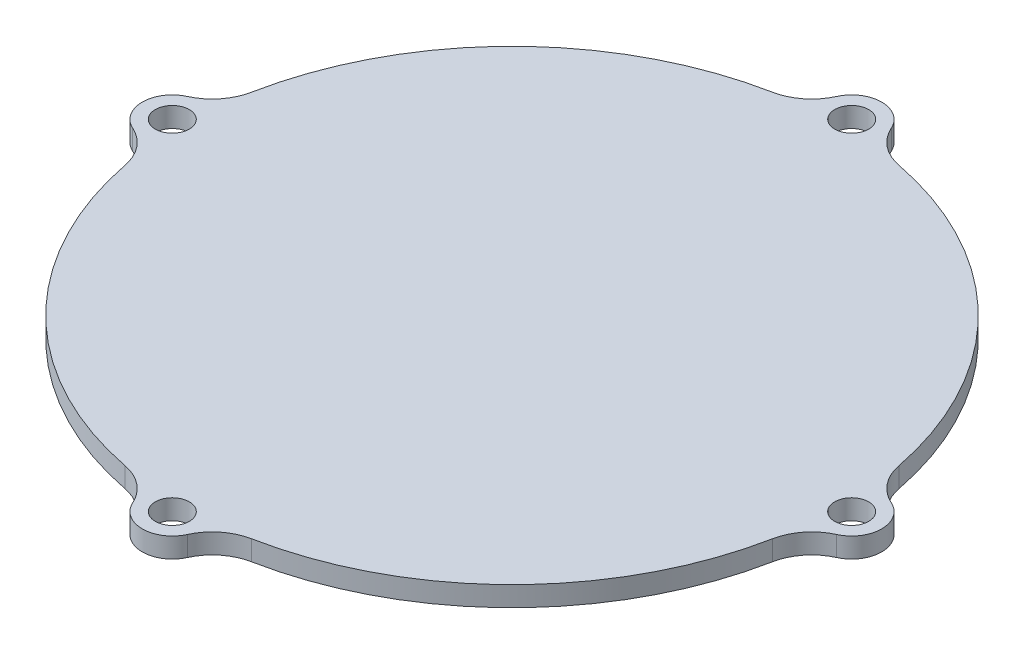
ISO-10303-21;
HEADER;
FILE_DESCRIPTION(('STEP AP214'),'2;1');
FILE_NAME('part.step','',(''),(''),'','','');
FILE_SCHEMA(('AUTOMOTIVE_DESIGN { 1 0 10303 214 1 1 1 1 }'));
ENDSEC;
DATA;
#1=APPLICATION_CONTEXT('core data for automotive mechanical design processes');
#2=APPLICATION_PROTOCOL_DEFINITION('international standard','automotive_design',2000,#1);
#3=PRODUCT_CONTEXT('',#1,'mechanical');
#4=PRODUCT('Part','Part','',(#3));
#5=PRODUCT_RELATED_PRODUCT_CATEGORY('part','',(#4));
#6=PRODUCT_DEFINITION_FORMATION('','',#4);
#7=PRODUCT_DEFINITION_CONTEXT('part definition',#1,'design');
#8=PRODUCT_DEFINITION('design','',#6,#7);
#9=PRODUCT_DEFINITION_SHAPE('','',#8);
#10=(LENGTH_UNIT() NAMED_UNIT(*) SI_UNIT(.MILLI.,.METRE.));
#11=(NAMED_UNIT(*) PLANE_ANGLE_UNIT() SI_UNIT($,.RADIAN.));
#12=(NAMED_UNIT(*) SI_UNIT($,.STERADIAN.) SOLID_ANGLE_UNIT());
#13=UNCERTAINTY_MEASURE_WITH_UNIT(LENGTH_MEASURE(1.E-05),#10,'distance_accuracy_value','');
#14=(GEOMETRIC_REPRESENTATION_CONTEXT(3) GLOBAL_UNCERTAINTY_ASSIGNED_CONTEXT((#13)) GLOBAL_UNIT_ASSIGNED_CONTEXT((#10,
#11,#12)) REPRESENTATION_CONTEXT('',''));
#15=CARTESIAN_POINT('',(0.,0.,0.));
#16=DIRECTION('',(0.,0.,1.));
#17=DIRECTION('',(1.,0.,0.));
#18=AXIS2_PLACEMENT_3D('',#15,#16,#17);
#19=CARTESIAN_POINT('',(0.,2.,0.));
#20=DIRECTION('',(0.,-1.,0.));
#21=DIRECTION('',(0.,0.,-1.));
#22=AXIS2_PLACEMENT_3D('',#19,#20,#21);
#23=CYLINDRICAL_SURFACE('',#22,33.);
#24=CARTESIAN_POINT('',(0.,0.,0.));
#25=DIRECTION('',(0.,1.,0.));
#26=DIRECTION('',(0.,0.,1.));
#27=AXIS2_PLACEMENT_3D('',#24,#25,#26);
#28=CIRCLE('',#27,33.);
#29=CARTESIAN_POINT('',(-6.33106875169509,0.,-32.3869969040248));
#30=VERTEX_POINT('',#29);
#31=CARTESIAN_POINT('',(-32.3869969040247,0.,-6.33106875169543));
#32=VERTEX_POINT('',#31);
#33=EDGE_CURVE('E165',#30,#32,#28,.T.);
#34=ORIENTED_EDGE('',*,*,#33,.T.);
#35=DIRECTION('',(0.,-1.,0.));
#36=VECTOR('',#35,1.);
#37=CARTESIAN_POINT('',(-32.3869969040247,2.,-6.33106875169543));
#38=LINE('',#37,#36);
#39=CARTESIAN_POINT('',(-32.3869969040247,2.,-6.33106875169543));
#40=VERTEX_POINT('',#39);
#41=EDGE_CURVE('E259',#32,#40,#38,.F.);
#42=ORIENTED_EDGE('',*,*,#41,.T.);
#43=CARTESIAN_POINT('',(0.,2.,0.));
#44=DIRECTION('',(0.,1.,0.));
#45=DIRECTION('',(0.,0.,1.));
#46=AXIS2_PLACEMENT_3D('',#43,#44,#45);
#47=CIRCLE('',#46,33.);
#48=CARTESIAN_POINT('',(-6.33106875169509,2.,-32.3869969040248));
#49=VERTEX_POINT('',#48);
#50=EDGE_CURVE('E167',#49,#40,#47,.T.);
#51=ORIENTED_EDGE('',*,*,#50,.F.);
#52=DIRECTION('',(0.,-1.,0.));
#53=VECTOR('',#52,1.);
#54=CARTESIAN_POINT('',(-6.3310687516951,2.,-32.3869969040248));
#55=LINE('',#54,#53);
#56=EDGE_CURVE('E157',#49,#30,#55,.T.);
#57=ORIENTED_EDGE('',*,*,#56,.T.);
#58=EDGE_LOOP('',(#34,#42,#51,#57));
#59=FACE_BOUND('',#58,.T.);
#60=ADVANCED_FACE('F40',(#59),#23,.T.);
#61=CARTESIAN_POINT('',(-32.3869969040248,2.,6.33106875169476));
#62=VERTEX_POINT('',#61);
#63=CARTESIAN_POINT('',(-6.33106875169509,2.,32.3869969040248));
#64=VERTEX_POINT('',#63);
#65=EDGE_CURVE('E196',#62,#64,#47,.T.);
#66=ORIENTED_EDGE('',*,*,#65,.F.);
#67=DIRECTION('',(0.,-1.,0.));
#68=VECTOR('',#67,1.);
#69=CARTESIAN_POINT('',(-32.3869969040248,2.,6.33106875169476));
#70=LINE('',#69,#68);
#71=CARTESIAN_POINT('',(-32.3869969040248,0.,6.33106875169476));
#72=VERTEX_POINT('',#71);
#73=EDGE_CURVE('E252',#62,#72,#70,.T.);
#74=ORIENTED_EDGE('',*,*,#73,.T.);
#75=CARTESIAN_POINT('',(-6.33106875169509,0.,32.3869969040248));
#76=VERTEX_POINT('',#75);
#77=EDGE_CURVE('E174',#72,#76,#28,.T.);
#78=ORIENTED_EDGE('',*,*,#77,.T.);
#79=DIRECTION('',(0.,-1.,0.));
#80=VECTOR('',#79,1.);
#81=CARTESIAN_POINT('',(-6.3310687516951,2.,32.3869969040248));
#82=LINE('',#81,#80);
#83=EDGE_CURVE('E241',#76,#64,#82,.F.);
#84=ORIENTED_EDGE('',*,*,#83,.T.);
#85=EDGE_LOOP('',(#66,#74,#78,#84));
#86=FACE_BOUND('',#85,.T.);
#87=ADVANCED_FACE('F288',(#86),#23,.T.);
#88=CARTESIAN_POINT('',(6.33106875169509,2.,32.3869969040248));
#89=VERTEX_POINT('',#88);
#90=CARTESIAN_POINT('',(32.3869969040247,2.,6.33106875169521));
#91=VERTEX_POINT('',#90);
#92=EDGE_CURVE('E177',#89,#91,#47,.T.);
#93=ORIENTED_EDGE('',*,*,#92,.F.);
#94=DIRECTION('',(0.,-1.,0.));
#95=VECTOR('',#94,1.);
#96=CARTESIAN_POINT('',(6.3310687516951,2.,32.3869969040248));
#97=LINE('',#96,#95);
#98=CARTESIAN_POINT('',(6.33106875169509,0.,32.3869969040248));
#99=VERTEX_POINT('',#98);
#100=EDGE_CURVE('E235',#89,#99,#97,.T.);
#101=ORIENTED_EDGE('',*,*,#100,.T.);
#102=CARTESIAN_POINT('',(32.3869969040247,0.,6.33106875169521));
#103=VERTEX_POINT('',#102);
#104=EDGE_CURVE('E179',#99,#103,#28,.T.);
#105=ORIENTED_EDGE('',*,*,#104,.T.);
#106=DIRECTION('',(0.,-1.,0.));
#107=VECTOR('',#106,1.);
#108=CARTESIAN_POINT('',(32.3869969040248,2.,6.33106875169521));
#109=LINE('',#108,#107);
#110=EDGE_CURVE('E218',#103,#91,#109,.F.);
#111=ORIENTED_EDGE('',*,*,#110,.T.);
#112=EDGE_LOOP('',(#93,#101,#105,#111));
#113=FACE_BOUND('',#112,.T.);
#114=ADVANCED_FACE('F223',(#113),#23,.T.);
#115=CARTESIAN_POINT('',(32.3869969040248,2.,-6.33106875169498));
#116=VERTEX_POINT('',#115);
#117=CARTESIAN_POINT('',(6.33106875169509,2.,-32.3869969040248));
#118=VERTEX_POINT('',#117);
#119=EDGE_CURVE('E173',#116,#118,#47,.T.);
#120=ORIENTED_EDGE('',*,*,#119,.F.);
#121=DIRECTION('',(0.,-1.,0.));
#122=VECTOR('',#121,1.);
#123=CARTESIAN_POINT('',(32.3869969040248,2.,-6.33106875169498));
#124=LINE('',#123,#122);
#125=CARTESIAN_POINT('',(32.3869969040248,0.,-6.33106875169498));
#126=VERTEX_POINT('',#125);
#127=EDGE_CURVE('E306',#116,#126,#124,.T.);
#128=ORIENTED_EDGE('',*,*,#127,.T.);
#129=CARTESIAN_POINT('',(6.33106875169509,0.,-32.3869969040248));
#130=VERTEX_POINT('',#129);
#131=EDGE_CURVE('E176',#126,#130,#28,.T.);
#132=ORIENTED_EDGE('',*,*,#131,.T.);
#133=DIRECTION('',(0.,-1.,0.));
#134=VECTOR('',#133,1.);
#135=CARTESIAN_POINT('',(6.3310687516951,2.,-32.3869969040248));
#136=LINE('',#135,#134);
#137=EDGE_CURVE('E169',#130,#118,#136,.F.);
#138=ORIENTED_EDGE('',*,*,#137,.T.);
#139=EDGE_LOOP('',(#120,#128,#132,#138));
#140=FACE_BOUND('',#139,.T.);
#141=ADVANCED_FACE('F290',(#140),#23,.T.);
#142=CARTESIAN_POINT('',(0.,2.,0.));
#143=DIRECTION('',(0.,1.,0.));
#144=DIRECTION('',(0.,0.,1.));
#145=AXIS2_PLACEMENT_3D('',#142,#143,#144);
#146=PLANE('',#145);
#147=CARTESIAN_POINT('',(0.,2.,34.));
#148=DIRECTION('',(0.,1.,0.));
#149=DIRECTION('',(0.,0.,1.));
#150=AXIS2_PLACEMENT_3D('',#147,#148,#149);
#151=CIRCLE('',#150,1.69999999999999);
#152=CARTESIAN_POINT('',(0.,2.,35.7));
#153=VERTEX_POINT('',#152);
#154=EDGE_CURVE('E385',#153,#153,#151,.T.);
#155=ORIENTED_EDGE('',*,*,#154,.F.);
#156=EDGE_LOOP('',(#155));
#157=FACE_BOUND('',#156,.T.);
#158=CARTESIAN_POINT('',(34.,2.,1.18710365520667E-13));
#159=DIRECTION('',(0.,1.,0.));
#160=DIRECTION('',(0.,0.,1.));
#161=AXIS2_PLACEMENT_3D('',#158,#159,#160);
#162=CIRCLE('',#161,1.69999999999999);
#163=CARTESIAN_POINT('',(34.,2.,1.7000000000001));
#164=VERTEX_POINT('',#163);
#165=EDGE_CURVE('E379',#164,#164,#162,.T.);
#166=ORIENTED_EDGE('',*,*,#165,.F.);
#167=EDGE_LOOP('',(#166));
#168=FACE_BOUND('',#167,.T.);
#169=CARTESIAN_POINT('',(0.,2.,-34.));
#170=DIRECTION('',(0.,1.,0.));
#171=DIRECTION('',(0.,0.,1.));
#172=AXIS2_PLACEMENT_3D('',#169,#170,#171);
#173=CIRCLE('',#172,1.69999999999999);
#174=CARTESIAN_POINT('',(0.,2.,-32.3));
#175=VERTEX_POINT('',#174);
#176=EDGE_CURVE('E373',#175,#175,#173,.T.);
#177=ORIENTED_EDGE('',*,*,#176,.F.);
#178=EDGE_LOOP('',(#177));
#179=FACE_BOUND('',#178,.T.);
#180=CARTESIAN_POINT('',(-34.,2.,-3.56131096562E-13));
#181=DIRECTION('',(0.,1.,0.));
#182=DIRECTION('',(0.,0.,1.));
#183=AXIS2_PLACEMENT_3D('',#180,#181,#182);
#184=CIRCLE('',#183,1.69999999999999);
#185=CARTESIAN_POINT('',(-34.,2.,1.69999999999963));
#186=VERTEX_POINT('',#185);
#187=EDGE_CURVE('E367',#186,#186,#184,.T.);
#188=ORIENTED_EDGE('',*,*,#187,.F.);
#189=EDGE_LOOP('',(#188));
#190=FACE_BOUND('',#189,.T.);
#191=ORIENTED_EDGE('',*,*,#50,.T.);
#192=CARTESIAN_POINT('',(-37.2941176470587,2.,-7.29032159286141));
#193=DIRECTION('',(0.,1.,0.));
#194=DIRECTION('',(0.,0.,1.));
#195=AXIS2_PLACEMENT_3D('',#192,#193,#194);
#196=CIRCLE('',#195,5.);
#197=CARTESIAN_POINT('',(-35.235294117647,2.,-2.73387059732325));
#198=VERTEX_POINT('',#197);
#199=EDGE_CURVE('E48',#40,#198,#196,.F.);
#200=ORIENTED_EDGE('',*,*,#199,.T.);
#201=CARTESIAN_POINT('',(-34.,2.,-3.56131096562E-13));
#202=DIRECTION('',(0.,1.,0.));
#203=DIRECTION('',(1.,0.,0.));
#204=AXIS2_PLACEMENT_3D('',#201,#202,#203);
#205=CIRCLE('',#204,3.);
#206=CARTESIAN_POINT('',(-35.2352941176471,2.,2.73387059732252));
#207=VERTEX_POINT('',#206);
#208=EDGE_CURVE('E266',#198,#207,#205,.T.);
#209=ORIENTED_EDGE('',*,*,#208,.T.);
#210=CARTESIAN_POINT('',(-37.2941176470589,2.,7.29032159286063));
#211=DIRECTION('',(0.,1.,0.));
#212=DIRECTION('',(0.,0.,1.));
#213=AXIS2_PLACEMENT_3D('',#210,#211,#212);
#214=CIRCLE('',#213,5.);
#215=EDGE_CURVE('E263',#207,#62,#214,.F.);
#216=ORIENTED_EDGE('',*,*,#215,.T.);
#217=ORIENTED_EDGE('',*,*,#65,.T.);
#218=CARTESIAN_POINT('',(-7.29032159286102,2.,37.2941176470588));
#219=DIRECTION('',(0.,1.,0.));
#220=DIRECTION('',(0.,0.,1.));
#221=AXIS2_PLACEMENT_3D('',#218,#219,#220);
#222=CIRCLE('',#221,5.);
#223=CARTESIAN_POINT('',(-2.73387059732288,2.,35.2352941176471));
#224=VERTEX_POINT('',#223);
#225=EDGE_CURVE('E247',#64,#224,#222,.F.);
#226=ORIENTED_EDGE('',*,*,#225,.T.);
#227=CARTESIAN_POINT('',(0.,2.,34.));
#228=DIRECTION('',(0.,1.,0.));
#229=DIRECTION('',(0.,0.,-1.));
#230=AXIS2_PLACEMENT_3D('',#227,#228,#229);
#231=CIRCLE('',#230,3.);
#232=CARTESIAN_POINT('',(2.73387059732288,2.,35.2352941176471));
#233=VERTEX_POINT('',#232);
#234=EDGE_CURVE('E358',#224,#233,#231,.T.);
#235=ORIENTED_EDGE('',*,*,#234,.T.);
#236=CARTESIAN_POINT('',(7.29032159286102,2.,37.2941176470588));
#237=DIRECTION('',(0.,1.,0.));
#238=DIRECTION('',(0.,0.,1.));
#239=AXIS2_PLACEMENT_3D('',#236,#237,#238);
#240=CIRCLE('',#239,5.);
#241=EDGE_CURVE('E208',#233,#89,#240,.F.);
#242=ORIENTED_EDGE('',*,*,#241,.T.);
#243=ORIENTED_EDGE('',*,*,#92,.T.);
#244=CARTESIAN_POINT('',(37.2941176470588,2.,7.29032159286115));
#245=DIRECTION('',(0.,1.,0.));
#246=DIRECTION('',(0.,0.,1.));
#247=AXIS2_PLACEMENT_3D('',#244,#245,#246);
#248=CIRCLE('',#247,5.);
#249=CARTESIAN_POINT('',(35.2352941176471,2.,2.73387059732301));
#250=VERTEX_POINT('',#249);
#251=EDGE_CURVE('E204',#91,#250,#248,.F.);
#252=ORIENTED_EDGE('',*,*,#251,.T.);
#253=CARTESIAN_POINT('',(34.,2.,1.18710365520667E-13));
#254=DIRECTION('',(0.,1.,0.));
#255=DIRECTION('',(-1.,0.,0.));
#256=AXIS2_PLACEMENT_3D('',#253,#254,#255);
#257=CIRCLE('',#256,3.);
#258=CARTESIAN_POINT('',(35.2352941176471,2.,-2.73387059732276));
#259=VERTEX_POINT('',#258);
#260=EDGE_CURVE('E194',#250,#259,#257,.T.);
#261=ORIENTED_EDGE('',*,*,#260,.T.);
#262=CARTESIAN_POINT('',(37.2941176470589,2.,-7.29032159286089));
#263=DIRECTION('',(0.,1.,0.));
#264=DIRECTION('',(0.,0.,1.));
#265=AXIS2_PLACEMENT_3D('',#262,#263,#264);
#266=CIRCLE('',#265,5.);
#267=EDGE_CURVE('E221',#259,#116,#266,.F.);
#268=ORIENTED_EDGE('',*,*,#267,.T.);
#269=ORIENTED_EDGE('',*,*,#119,.T.);
#270=CARTESIAN_POINT('',(7.29032159286102,2.,-37.2941176470588));
#271=DIRECTION('',(0.,1.,0.));
#272=DIRECTION('',(0.,0.,1.));
#273=AXIS2_PLACEMENT_3D('',#270,#271,#272);
#274=CIRCLE('',#273,5.);
#275=CARTESIAN_POINT('',(2.73387059732288,2.,-35.2352941176471));
#276=VERTEX_POINT('',#275);
#277=EDGE_CURVE('E315',#118,#276,#274,.F.);
#278=ORIENTED_EDGE('',*,*,#277,.T.);
#279=CARTESIAN_POINT('',(0.,2.,-34.));
#280=DIRECTION('',(0.,1.,0.));
#281=DIRECTION('',(0.,0.,1.));
#282=AXIS2_PLACEMENT_3D('',#279,#280,#281);
#283=CIRCLE('',#282,3.);
#284=CARTESIAN_POINT('',(-2.73387059732288,2.,-35.2352941176471));
#285=VERTEX_POINT('',#284);
#286=EDGE_CURVE('E187',#276,#285,#283,.T.);
#287=ORIENTED_EDGE('',*,*,#286,.T.);
#288=CARTESIAN_POINT('',(-7.29032159286102,2.,-37.2941176470588));
#289=DIRECTION('',(0.,1.,0.));
#290=DIRECTION('',(0.,0.,1.));
#291=AXIS2_PLACEMENT_3D('',#288,#289,#290);
#292=CIRCLE('',#291,5.);
#293=EDGE_CURVE('E161',#285,#49,#292,.F.);
#294=ORIENTED_EDGE('',*,*,#293,.T.);
#295=EDGE_LOOP('',(#191,#200,#209,#216,#217,#226,#235,#242,#243,#252,#261,#268,#269,#278,#287,#294));
#296=FACE_BOUND('',#295,.T.);
#297=ADVANCED_FACE('F202',(#157,#168,#179,#190,#296),#146,.T.);
#298=CARTESIAN_POINT('',(0.,0.,0.));
#299=DIRECTION('',(0.,1.,0.));
#300=DIRECTION('',(0.,0.,1.));
#301=AXIS2_PLACEMENT_3D('',#298,#299,#300);
#302=PLANE('',#301);
#303=CARTESIAN_POINT('',(0.,0.,34.));
#304=DIRECTION('',(0.,1.,0.));
#305=DIRECTION('',(0.,0.,1.));
#306=AXIS2_PLACEMENT_3D('',#303,#304,#305);
#307=CIRCLE('',#306,1.7);
#308=CARTESIAN_POINT('',(0.,0.,35.7));
#309=VERTEX_POINT('',#308);
#310=EDGE_CURVE('E382',#309,#309,#307,.T.);
#311=ORIENTED_EDGE('',*,*,#310,.T.);
#312=EDGE_LOOP('',(#311));
#313=FACE_BOUND('',#312,.T.);
#314=CARTESIAN_POINT('',(34.,0.,1.18710365520667E-13));
#315=DIRECTION('',(0.,1.,0.));
#316=DIRECTION('',(0.,0.,1.));
#317=AXIS2_PLACEMENT_3D('',#314,#315,#316);
#318=CIRCLE('',#317,1.7);
#319=CARTESIAN_POINT('',(34.,0.,1.70000000000012));
#320=VERTEX_POINT('',#319);
#321=EDGE_CURVE('E376',#320,#320,#318,.T.);
#322=ORIENTED_EDGE('',*,*,#321,.T.);
#323=EDGE_LOOP('',(#322));
#324=FACE_BOUND('',#323,.T.);
#325=CARTESIAN_POINT('',(0.,0.,-34.));
#326=DIRECTION('',(0.,1.,0.));
#327=DIRECTION('',(0.,0.,1.));
#328=AXIS2_PLACEMENT_3D('',#325,#326,#327);
#329=CIRCLE('',#328,1.7);
#330=CARTESIAN_POINT('',(0.,0.,-32.3));
#331=VERTEX_POINT('',#330);
#332=EDGE_CURVE('E370',#331,#331,#329,.T.);
#333=ORIENTED_EDGE('',*,*,#332,.T.);
#334=EDGE_LOOP('',(#333));
#335=FACE_BOUND('',#334,.T.);
#336=CARTESIAN_POINT('',(-34.,0.,-3.56131096562E-13));
#337=DIRECTION('',(0.,1.,0.));
#338=DIRECTION('',(0.,0.,1.));
#339=AXIS2_PLACEMENT_3D('',#336,#337,#338);
#340=CIRCLE('',#339,1.7);
#341=CARTESIAN_POINT('',(-34.,0.,1.69999999999964));
#342=VERTEX_POINT('',#341);
#343=EDGE_CURVE('E273',#342,#342,#340,.T.);
#344=ORIENTED_EDGE('',*,*,#343,.T.);
#345=EDGE_LOOP('',(#344));
#346=FACE_BOUND('',#345,.T.);
#347=ORIENTED_EDGE('',*,*,#77,.F.);
#348=CARTESIAN_POINT('',(-37.2941176470589,0.,7.29032159286063));
#349=DIRECTION('',(0.,1.,0.));
#350=DIRECTION('',(0.,0.,1.));
#351=AXIS2_PLACEMENT_3D('',#348,#349,#350);
#352=CIRCLE('',#351,5.);
#353=CARTESIAN_POINT('',(-35.2352941176471,0.,2.73387059732252));
#354=VERTEX_POINT('',#353);
#355=EDGE_CURVE('E261',#72,#354,#352,.T.);
#356=ORIENTED_EDGE('',*,*,#355,.T.);
#357=CARTESIAN_POINT('',(-34.,0.,-3.56131096562E-13));
#358=DIRECTION('',(0.,1.,0.));
#359=DIRECTION('',(1.,0.,0.));
#360=AXIS2_PLACEMENT_3D('',#357,#358,#359);
#361=CIRCLE('',#360,3.);
#362=CARTESIAN_POINT('',(-35.235294117647,0.,-2.73387059732325));
#363=VERTEX_POINT('',#362);
#364=EDGE_CURVE('E272',#363,#354,#361,.T.);
#365=ORIENTED_EDGE('',*,*,#364,.F.);
#366=CARTESIAN_POINT('',(-37.2941176470587,0.,-7.29032159286141));
#367=DIRECTION('',(0.,1.,0.));
#368=DIRECTION('',(0.,0.,1.));
#369=AXIS2_PLACEMENT_3D('',#366,#367,#368);
#370=CIRCLE('',#369,5.);
#371=EDGE_CURVE('E11',#363,#32,#370,.T.);
#372=ORIENTED_EDGE('',*,*,#371,.T.);
#373=ORIENTED_EDGE('',*,*,#33,.F.);
#374=CARTESIAN_POINT('',(-7.29032159286102,0.,-37.2941176470588));
#375=DIRECTION('',(0.,1.,0.));
#376=DIRECTION('',(0.,0.,1.));
#377=AXIS2_PLACEMENT_3D('',#374,#375,#376);
#378=CIRCLE('',#377,5.);
#379=CARTESIAN_POINT('',(-2.73387059732288,0.,-35.2352941176471));
#380=VERTEX_POINT('',#379);
#381=EDGE_CURVE('E153',#30,#380,#378,.T.);
#382=ORIENTED_EDGE('',*,*,#381,.T.);
#383=CARTESIAN_POINT('',(0.,0.,-34.));
#384=DIRECTION('',(0.,1.,0.));
#385=DIRECTION('',(0.,0.,1.));
#386=AXIS2_PLACEMENT_3D('',#383,#384,#385);
#387=CIRCLE('',#386,3.);
#388=CARTESIAN_POINT('',(2.73387059732288,0.,-35.2352941176471));
#389=VERTEX_POINT('',#388);
#390=EDGE_CURVE('E181',#389,#380,#387,.T.);
#391=ORIENTED_EDGE('',*,*,#390,.F.);
#392=CARTESIAN_POINT('',(7.29032159286102,0.,-37.2941176470588));
#393=DIRECTION('',(0.,1.,0.));
#394=DIRECTION('',(0.,0.,1.));
#395=AXIS2_PLACEMENT_3D('',#392,#393,#394);
#396=CIRCLE('',#395,5.);
#397=EDGE_CURVE('E313',#389,#130,#396,.T.);
#398=ORIENTED_EDGE('',*,*,#397,.T.);
#399=ORIENTED_EDGE('',*,*,#131,.F.);
#400=CARTESIAN_POINT('',(37.2941176470589,0.,-7.29032159286089));
#401=DIRECTION('',(0.,1.,0.));
#402=DIRECTION('',(0.,0.,1.));
#403=AXIS2_PLACEMENT_3D('',#400,#401,#402);
#404=CIRCLE('',#403,5.);
#405=CARTESIAN_POINT('',(35.2352941176471,0.,-2.73387059732276));
#406=VERTEX_POINT('',#405);
#407=EDGE_CURVE('E226',#126,#406,#404,.T.);
#408=ORIENTED_EDGE('',*,*,#407,.T.);
#409=CARTESIAN_POINT('',(34.,0.,1.18710365520667E-13));
#410=DIRECTION('',(0.,1.,0.));
#411=DIRECTION('',(-1.,0.,0.));
#412=AXIS2_PLACEMENT_3D('',#409,#410,#411);
#413=CIRCLE('',#412,3.);
#414=CARTESIAN_POINT('',(35.2352941176471,0.,2.73387059732301));
#415=VERTEX_POINT('',#414);
#416=EDGE_CURVE('E191',#415,#406,#413,.T.);
#417=ORIENTED_EDGE('',*,*,#416,.F.);
#418=CARTESIAN_POINT('',(37.2941176470588,0.,7.29032159286115));
#419=DIRECTION('',(0.,1.,0.));
#420=DIRECTION('',(0.,0.,1.));
#421=AXIS2_PLACEMENT_3D('',#418,#419,#420);
#422=CIRCLE('',#421,5.);
#423=EDGE_CURVE('E220',#415,#103,#422,.T.);
#424=ORIENTED_EDGE('',*,*,#423,.T.);
#425=ORIENTED_EDGE('',*,*,#104,.F.);
#426=CARTESIAN_POINT('',(7.29032159286102,0.,37.2941176470588));
#427=DIRECTION('',(0.,1.,0.));
#428=DIRECTION('',(0.,0.,1.));
#429=AXIS2_PLACEMENT_3D('',#426,#427,#428);
#430=CIRCLE('',#429,5.);
#431=CARTESIAN_POINT('',(2.73387059732288,0.,35.2352941176471));
#432=VERTEX_POINT('',#431);
#433=EDGE_CURVE('E244',#99,#432,#430,.T.);
#434=ORIENTED_EDGE('',*,*,#433,.T.);
#435=CARTESIAN_POINT('',(0.,0.,34.));
#436=DIRECTION('',(0.,1.,0.));
#437=DIRECTION('',(0.,0.,-1.));
#438=AXIS2_PLACEMENT_3D('',#435,#436,#437);
#439=CIRCLE('',#438,3.);
#440=CARTESIAN_POINT('',(-2.73387059732288,0.,35.2352941176471));
#441=VERTEX_POINT('',#440);
#442=EDGE_CURVE('E355',#441,#432,#439,.T.);
#443=ORIENTED_EDGE('',*,*,#442,.F.);
#444=CARTESIAN_POINT('',(-7.29032159286102,0.,37.2941176470588));
#445=DIRECTION('',(0.,1.,0.));
#446=DIRECTION('',(0.,0.,1.));
#447=AXIS2_PLACEMENT_3D('',#444,#445,#446);
#448=CIRCLE('',#447,5.);
#449=EDGE_CURVE('E249',#441,#76,#448,.T.);
#450=ORIENTED_EDGE('',*,*,#449,.T.);
#451=EDGE_LOOP('',(#347,#356,#365,#372,#373,#382,#391,#398,#399,#408,#417,#424,#425,#434,#443,#450));
#452=FACE_BOUND('',#451,.T.);
#453=ADVANCED_FACE('F172',(#313,#324,#335,#346,#452),#302,.F.);
#454=CARTESIAN_POINT('',(0.,0.,-34.));
#455=DIRECTION('',(0.,1.,0.));
#456=DIRECTION('',(0.,0.,1.));
#457=AXIS2_PLACEMENT_3D('',#454,#455,#456);
#458=CYLINDRICAL_SURFACE('',#457,3.);
#459=ORIENTED_EDGE('',*,*,#390,.T.);
#460=DIRECTION('',(0.,1.,0.));
#461=VECTOR('',#460,1.);
#462=CARTESIAN_POINT('',(-2.73387059732288,0.,-35.2352941176471));
#463=LINE('',#462,#461);
#464=EDGE_CURVE('E158',#380,#285,#463,.T.);
#465=ORIENTED_EDGE('',*,*,#464,.T.);
#466=ORIENTED_EDGE('',*,*,#286,.F.);
#467=DIRECTION('',(0.,1.,0.));
#468=VECTOR('',#467,1.);
#469=CARTESIAN_POINT('',(2.73387059732288,0.,-35.2352941176471));
#470=LINE('',#469,#468);
#471=EDGE_CURVE('E168',#276,#389,#470,.F.);
#472=ORIENTED_EDGE('',*,*,#471,.T.);
#473=EDGE_LOOP('',(#459,#465,#466,#472));
#474=FACE_BOUND('',#473,.T.);
#475=ADVANCED_FACE('F323',(#474),#458,.T.);
#476=CARTESIAN_POINT('',(-7.29032159286102,0.,-37.2941176470588));
#477=DIRECTION('',(0.,1.,0.));
#478=DIRECTION('',(0.,0.,1.));
#479=AXIS2_PLACEMENT_3D('',#476,#477,#478);
#480=CYLINDRICAL_SURFACE('',#479,5.);
#481=ORIENTED_EDGE('',*,*,#293,.F.);
#482=ORIENTED_EDGE('',*,*,#464,.F.);
#483=ORIENTED_EDGE('',*,*,#381,.F.);
#484=ORIENTED_EDGE('',*,*,#56,.F.);
#485=EDGE_LOOP('',(#481,#482,#483,#484));
#486=FACE_BOUND('',#485,.T.);
#487=ADVANCED_FACE('F156',(#486),#480,.F.);
#488=CARTESIAN_POINT('',(7.29032159286102,0.,-37.2941176470588));
#489=DIRECTION('',(0.,-1.,0.));
#490=DIRECTION('',(0.,0.,-1.));
#491=AXIS2_PLACEMENT_3D('',#488,#489,#490);
#492=CYLINDRICAL_SURFACE('',#491,5.);
#493=ORIENTED_EDGE('',*,*,#397,.F.);
#494=ORIENTED_EDGE('',*,*,#471,.F.);
#495=ORIENTED_EDGE('',*,*,#277,.F.);
#496=ORIENTED_EDGE('',*,*,#137,.F.);
#497=EDGE_LOOP('',(#493,#494,#495,#496));
#498=FACE_BOUND('',#497,.T.);
#499=ADVANCED_FACE('F326',(#498),#492,.F.);
#500=CARTESIAN_POINT('',(34.,0.,1.18710365520667E-13));
#501=DIRECTION('',(0.,1.,0.));
#502=DIRECTION('',(0.,0.,1.));
#503=AXIS2_PLACEMENT_3D('',#500,#501,#502);
#504=CYLINDRICAL_SURFACE('',#503,3.);
#505=ORIENTED_EDGE('',*,*,#416,.T.);
#506=DIRECTION('',(0.,1.,0.));
#507=VECTOR('',#506,1.);
#508=CARTESIAN_POINT('',(35.2352941176471,0.,-2.73387059732276));
#509=LINE('',#508,#507);
#510=EDGE_CURVE('E227',#406,#259,#509,.T.);
#511=ORIENTED_EDGE('',*,*,#510,.T.);
#512=ORIENTED_EDGE('',*,*,#260,.F.);
#513=DIRECTION('',(0.,1.,0.));
#514=VECTOR('',#513,1.);
#515=CARTESIAN_POINT('',(35.2352941176471,0.,2.73387059732301));
#516=LINE('',#515,#514);
#517=EDGE_CURVE('E219',#250,#415,#516,.F.);
#518=ORIENTED_EDGE('',*,*,#517,.T.);
#519=EDGE_LOOP('',(#505,#511,#512,#518));
#520=FACE_BOUND('',#519,.T.);
#521=ADVANCED_FACE('F328',(#520),#504,.T.);
#522=CARTESIAN_POINT('',(0.,0.,34.));
#523=DIRECTION('',(0.,1.,0.));
#524=DIRECTION('',(0.,0.,1.));
#525=AXIS2_PLACEMENT_3D('',#522,#523,#524);
#526=CYLINDRICAL_SURFACE('',#525,3.);
#527=ORIENTED_EDGE('',*,*,#442,.T.);
#528=DIRECTION('',(0.,1.,0.));
#529=VECTOR('',#528,1.);
#530=CARTESIAN_POINT('',(2.73387059732288,0.,35.2352941176471));
#531=LINE('',#530,#529);
#532=EDGE_CURVE('E239',#432,#233,#531,.T.);
#533=ORIENTED_EDGE('',*,*,#532,.T.);
#534=ORIENTED_EDGE('',*,*,#234,.F.);
#535=DIRECTION('',(0.,1.,0.));
#536=VECTOR('',#535,1.);
#537=CARTESIAN_POINT('',(-2.73387059732288,0.,35.2352941176471));
#538=LINE('',#537,#536);
#539=EDGE_CURVE('E237',#224,#441,#538,.F.);
#540=ORIENTED_EDGE('',*,*,#539,.T.);
#541=EDGE_LOOP('',(#527,#533,#534,#540));
#542=FACE_BOUND('',#541,.T.);
#543=ADVANCED_FACE('F334',(#542),#526,.T.);
#544=CARTESIAN_POINT('',(-34.,0.,-3.56131096562E-13));
#545=DIRECTION('',(0.,1.,0.));
#546=DIRECTION('',(0.,0.,1.));
#547=AXIS2_PLACEMENT_3D('',#544,#545,#546);
#548=CYLINDRICAL_SURFACE('',#547,3.);
#549=ORIENTED_EDGE('',*,*,#364,.T.);
#550=DIRECTION('',(0.,1.,0.));
#551=VECTOR('',#550,1.);
#552=CARTESIAN_POINT('',(-35.2352941176471,0.,2.73387059732252));
#553=LINE('',#552,#551);
#554=EDGE_CURVE('E257',#354,#207,#553,.T.);
#555=ORIENTED_EDGE('',*,*,#554,.T.);
#556=ORIENTED_EDGE('',*,*,#208,.F.);
#557=DIRECTION('',(0.,1.,0.));
#558=VECTOR('',#557,1.);
#559=CARTESIAN_POINT('',(-35.235294117647,0.,-2.73387059732325));
#560=LINE('',#559,#558);
#561=EDGE_CURVE('E255',#198,#363,#560,.F.);
#562=ORIENTED_EDGE('',*,*,#561,.T.);
#563=EDGE_LOOP('',(#549,#555,#556,#562));
#564=FACE_BOUND('',#563,.T.);
#565=ADVANCED_FACE('F270',(#564),#548,.T.);
#566=CARTESIAN_POINT('',(37.2941176470589,0.,-7.29032159286089));
#567=DIRECTION('',(0.,1.,0.));
#568=DIRECTION('',(0.,0.,1.));
#569=AXIS2_PLACEMENT_3D('',#566,#567,#568);
#570=CYLINDRICAL_SURFACE('',#569,5.);
#571=ORIENTED_EDGE('',*,*,#267,.F.);
#572=ORIENTED_EDGE('',*,*,#510,.F.);
#573=ORIENTED_EDGE('',*,*,#407,.F.);
#574=ORIENTED_EDGE('',*,*,#127,.F.);
#575=EDGE_LOOP('',(#571,#572,#573,#574));
#576=FACE_BOUND('',#575,.T.);
#577=ADVANCED_FACE('F311',(#576),#570,.F.);
#578=CARTESIAN_POINT('',(37.2941176470588,0.,7.29032159286115));
#579=DIRECTION('',(0.,-1.,0.));
#580=DIRECTION('',(0.,0.,-1.));
#581=AXIS2_PLACEMENT_3D('',#578,#579,#580);
#582=CYLINDRICAL_SURFACE('',#581,5.);
#583=ORIENTED_EDGE('',*,*,#423,.F.);
#584=ORIENTED_EDGE('',*,*,#517,.F.);
#585=ORIENTED_EDGE('',*,*,#251,.F.);
#586=ORIENTED_EDGE('',*,*,#110,.F.);
#587=EDGE_LOOP('',(#583,#584,#585,#586));
#588=FACE_BOUND('',#587,.T.);
#589=ADVANCED_FACE('F217',(#588),#582,.F.);
#590=CARTESIAN_POINT('',(7.29032159286102,0.,37.2941176470588));
#591=DIRECTION('',(0.,1.,0.));
#592=DIRECTION('',(0.,0.,1.));
#593=AXIS2_PLACEMENT_3D('',#590,#591,#592);
#594=CYLINDRICAL_SURFACE('',#593,5.);
#595=ORIENTED_EDGE('',*,*,#241,.F.);
#596=ORIENTED_EDGE('',*,*,#532,.F.);
#597=ORIENTED_EDGE('',*,*,#433,.F.);
#598=ORIENTED_EDGE('',*,*,#100,.F.);
#599=EDGE_LOOP('',(#595,#596,#597,#598));
#600=FACE_BOUND('',#599,.T.);
#601=ADVANCED_FACE('F342',(#600),#594,.F.);
#602=CARTESIAN_POINT('',(-7.29032159286102,0.,37.2941176470588));
#603=DIRECTION('',(0.,-1.,0.));
#604=DIRECTION('',(0.,0.,-1.));
#605=AXIS2_PLACEMENT_3D('',#602,#603,#604);
#606=CYLINDRICAL_SURFACE('',#605,5.);
#607=ORIENTED_EDGE('',*,*,#449,.F.);
#608=ORIENTED_EDGE('',*,*,#539,.F.);
#609=ORIENTED_EDGE('',*,*,#225,.F.);
#610=ORIENTED_EDGE('',*,*,#83,.F.);
#611=EDGE_LOOP('',(#607,#608,#609,#610));
#612=FACE_BOUND('',#611,.T.);
#613=ADVANCED_FACE('F285',(#612),#606,.F.);
#614=CARTESIAN_POINT('',(-37.2941176470589,0.,7.29032159286063));
#615=DIRECTION('',(0.,1.,0.));
#616=DIRECTION('',(0.,0.,1.));
#617=AXIS2_PLACEMENT_3D('',#614,#615,#616);
#618=CYLINDRICAL_SURFACE('',#617,5.);
#619=ORIENTED_EDGE('',*,*,#215,.F.);
#620=ORIENTED_EDGE('',*,*,#554,.F.);
#621=ORIENTED_EDGE('',*,*,#355,.F.);
#622=ORIENTED_EDGE('',*,*,#73,.F.);
#623=EDGE_LOOP('',(#619,#620,#621,#622));
#624=FACE_BOUND('',#623,.T.);
#625=ADVANCED_FACE('F277',(#624),#618,.F.);
#626=CARTESIAN_POINT('',(-37.2941176470587,0.,-7.29032159286141));
#627=DIRECTION('',(0.,-1.,0.));
#628=DIRECTION('',(0.,0.,-1.));
#629=AXIS2_PLACEMENT_3D('',#626,#627,#628);
#630=CYLINDRICAL_SURFACE('',#629,5.);
#631=ORIENTED_EDGE('',*,*,#371,.F.);
#632=ORIENTED_EDGE('',*,*,#561,.F.);
#633=ORIENTED_EDGE('',*,*,#199,.F.);
#634=ORIENTED_EDGE('',*,*,#41,.F.);
#635=EDGE_LOOP('',(#631,#632,#633,#634));
#636=FACE_BOUND('',#635,.T.);
#637=ADVANCED_FACE('F42',(#636),#630,.F.);
#638=CARTESIAN_POINT('',(-34.,2.,-3.56131096562E-13));
#639=DIRECTION('',(0.,1.,0.));
#640=DIRECTION('',(0.,0.,1.));
#641=AXIS2_PLACEMENT_3D('',#638,#639,#640);
#642=CYLINDRICAL_SURFACE('',#641,1.69999999999999);
#643=ORIENTED_EDGE('',*,*,#343,.F.);
#644=EDGE_LOOP('',(#643));
#645=FACE_BOUND('',#644,.T.);
#646=ORIENTED_EDGE('',*,*,#187,.T.);
#647=EDGE_LOOP('',(#646));
#648=FACE_BOUND('',#647,.T.);
#649=ADVANCED_FACE('F276',(#645,#648),#642,.F.);
#650=CARTESIAN_POINT('',(0.,2.,-34.));
#651=DIRECTION('',(0.,1.,0.));
#652=DIRECTION('',(0.,0.,1.));
#653=AXIS2_PLACEMENT_3D('',#650,#651,#652);
#654=CYLINDRICAL_SURFACE('',#653,1.69999999999999);
#655=ORIENTED_EDGE('',*,*,#332,.F.);
#656=EDGE_LOOP('',(#655));
#657=FACE_BOUND('',#656,.T.);
#658=ORIENTED_EDGE('',*,*,#176,.T.);
#659=EDGE_LOOP('',(#658));
#660=FACE_BOUND('',#659,.T.);
#661=ADVANCED_FACE('F282',(#657,#660),#654,.F.);
#662=CARTESIAN_POINT('',(34.,2.,1.18710365520667E-13));
#663=DIRECTION('',(0.,1.,0.));
#664=DIRECTION('',(0.,0.,1.));
#665=AXIS2_PLACEMENT_3D('',#662,#663,#664);
#666=CYLINDRICAL_SURFACE('',#665,1.69999999999999);
#667=ORIENTED_EDGE('',*,*,#321,.F.);
#668=EDGE_LOOP('',(#667));
#669=FACE_BOUND('',#668,.T.);
#670=ORIENTED_EDGE('',*,*,#165,.T.);
#671=EDGE_LOOP('',(#670));
#672=FACE_BOUND('',#671,.T.);
#673=ADVANCED_FACE('F399',(#669,#672),#666,.F.);
#674=CARTESIAN_POINT('',(0.,2.,34.));
#675=DIRECTION('',(0.,1.,0.));
#676=DIRECTION('',(0.,0.,1.));
#677=AXIS2_PLACEMENT_3D('',#674,#675,#676);
#678=CYLINDRICAL_SURFACE('',#677,1.69999999999999);
#679=ORIENTED_EDGE('',*,*,#310,.F.);
#680=EDGE_LOOP('',(#679));
#681=FACE_BOUND('',#680,.T.);
#682=ORIENTED_EDGE('',*,*,#154,.T.);
#683=EDGE_LOOP('',(#682));
#684=FACE_BOUND('',#683,.T.);
#685=ADVANCED_FACE('F389',(#681,#684),#678,.F.);
#686=CLOSED_SHELL('',(#60,#87,#114,#141,#297,#453,#475,#487,#499,#521,#543,#565,#577,#589,#601,
#613,#625,#637,#649,#661,#673,#685));
#687=MANIFOLD_SOLID_BREP('B2',#686);
#688=ADVANCED_BREP_SHAPE_REPRESENTATION('',(#18,#687),#14);
#689=SHAPE_DEFINITION_REPRESENTATION(#9,#688);
ENDSEC;
END-ISO-10303-21;
